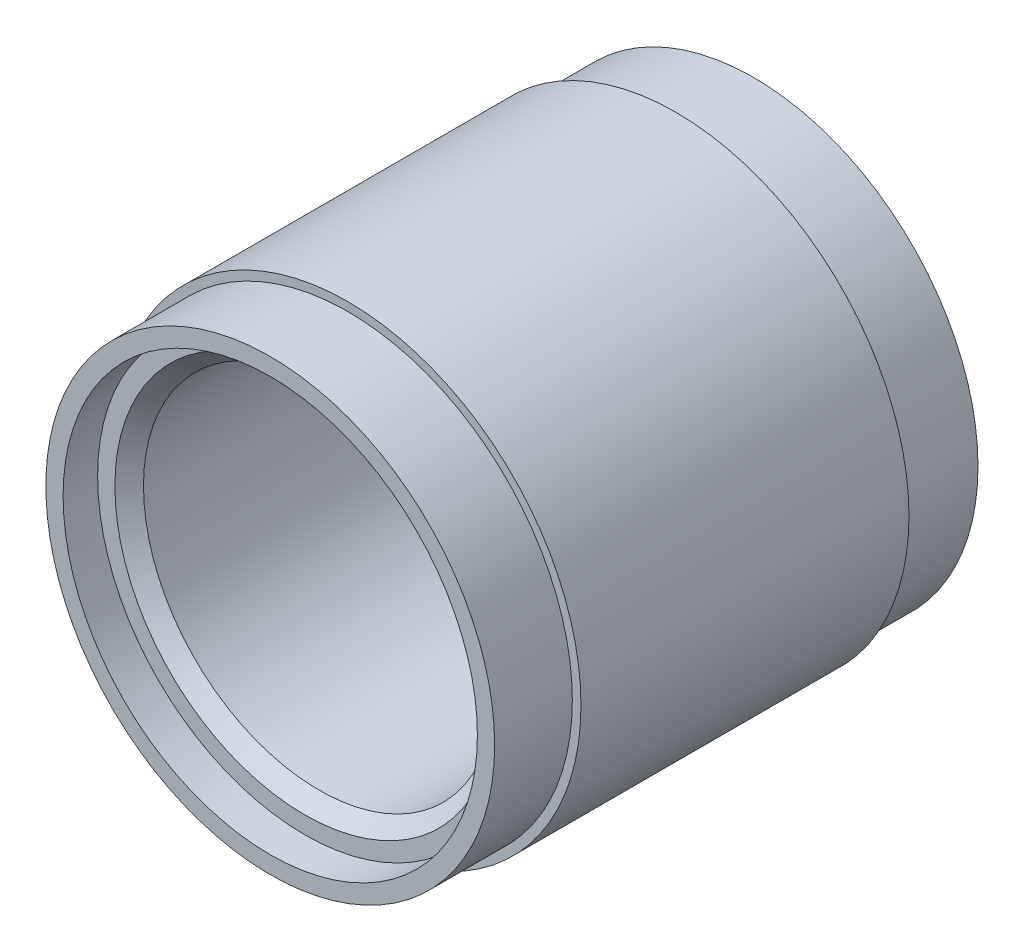
ISO-10303-21;
HEADER;
FILE_DESCRIPTION(('STEP AP214'),'2;1');
FILE_NAME('part.step','',(''),(''),'','','');
FILE_SCHEMA(('AUTOMOTIVE_DESIGN { 1 0 10303 214 1 1 1 1 }'));
ENDSEC;
DATA;
#1=APPLICATION_CONTEXT('core data for automotive mechanical design processes');
#2=APPLICATION_PROTOCOL_DEFINITION('international standard','automotive_design',2000,#1);
#3=PRODUCT_CONTEXT('',#1,'mechanical');
#4=PRODUCT('Part','Part','',(#3));
#5=PRODUCT_RELATED_PRODUCT_CATEGORY('part','',(#4));
#6=PRODUCT_DEFINITION_FORMATION('','',#4);
#7=PRODUCT_DEFINITION_CONTEXT('part definition',#1,'design');
#8=PRODUCT_DEFINITION('design','',#6,#7);
#9=PRODUCT_DEFINITION_SHAPE('','',#8);
#10=(LENGTH_UNIT() NAMED_UNIT(*) SI_UNIT(.MILLI.,.METRE.));
#11=(NAMED_UNIT(*) PLANE_ANGLE_UNIT() SI_UNIT($,.RADIAN.));
#12=(NAMED_UNIT(*) SI_UNIT($,.STERADIAN.) SOLID_ANGLE_UNIT());
#13=UNCERTAINTY_MEASURE_WITH_UNIT(LENGTH_MEASURE(1.E-05),#10,'distance_accuracy_value','');
#14=(GEOMETRIC_REPRESENTATION_CONTEXT(3) GLOBAL_UNCERTAINTY_ASSIGNED_CONTEXT((#13)) GLOBAL_UNIT_ASSIGNED_CONTEXT((#10,
#11,#12)) REPRESENTATION_CONTEXT('',''));
#15=CARTESIAN_POINT('',(0.,0.,0.));
#16=DIRECTION('',(0.,0.,1.));
#17=DIRECTION('',(1.,0.,0.));
#18=AXIS2_PLACEMENT_3D('',#15,#16,#17);
#19=CARTESIAN_POINT('',(0.,0.,4.5));
#20=DIRECTION('',(0.,0.,-1.));
#21=DIRECTION('',(-1.,0.,0.));
#22=AXIS2_PLACEMENT_3D('',#19,#20,#21);
#23=CYLINDRICAL_SURFACE('',#22,13.);
#24=CARTESIAN_POINT('',(0.,0.,4.5));
#25=DIRECTION('',(0.,0.,1.));
#26=DIRECTION('',(1.,0.,0.));
#27=AXIS2_PLACEMENT_3D('',#24,#25,#26);
#28=CIRCLE('',#27,13.);
#29=CARTESIAN_POINT('',(13.,0.,4.5));
#30=VERTEX_POINT('',#29);
#31=EDGE_CURVE('E54',#30,#30,#28,.T.);
#32=ORIENTED_EDGE('',*,*,#31,.F.);
#33=EDGE_LOOP('',(#32));
#34=FACE_BOUND('',#33,.T.);
#35=CARTESIAN_POINT('',(0.,0.,0.));
#36=DIRECTION('',(0.,0.,1.));
#37=DIRECTION('',(1.,0.,0.));
#38=AXIS2_PLACEMENT_3D('',#35,#36,#37);
#39=CIRCLE('',#38,13.);
#40=CARTESIAN_POINT('',(13.,0.,0.));
#41=VERTEX_POINT('',#40);
#42=EDGE_CURVE('E55',#41,#41,#39,.T.);
#43=ORIENTED_EDGE('',*,*,#42,.T.);
#44=EDGE_LOOP('',(#43));
#45=FACE_BOUND('',#44,.T.);
#46=ADVANCED_FACE('F34',(#34,#45),#23,.T.);
#47=CARTESIAN_POINT('',(0.,0.,0.));
#48=DIRECTION('',(0.,0.,1.));
#49=DIRECTION('',(1.,0.,0.));
#50=AXIS2_PLACEMENT_3D('',#47,#48,#49);
#51=PLANE('',#50);
#52=CARTESIAN_POINT('',(0.,0.,0.));
#53=DIRECTION('',(0.,0.,-1.));
#54=DIRECTION('',(-1.,0.,0.));
#55=AXIS2_PLACEMENT_3D('',#52,#53,#54);
#56=CIRCLE('',#55,12.);
#57=CARTESIAN_POINT('',(-12.,0.,0.));
#58=VERTEX_POINT('',#57);
#59=EDGE_CURVE('E64',#58,#58,#56,.T.);
#60=ORIENTED_EDGE('',*,*,#59,.F.);
#61=EDGE_LOOP('',(#60));
#62=FACE_BOUND('',#61,.T.);
#63=ORIENTED_EDGE('',*,*,#42,.F.);
#64=EDGE_LOOP('',(#63));
#65=FACE_BOUND('',#64,.T.);
#66=ADVANCED_FACE('F102',(#62,#65),#51,.F.);
#67=CARTESIAN_POINT('',(0.,0.,4.5));
#68=DIRECTION('',(0.,0.,1.));
#69=DIRECTION('',(1.,0.,0.));
#70=AXIS2_PLACEMENT_3D('',#67,#68,#69);
#71=PLANE('',#70);
#72=CARTESIAN_POINT('',(0.,0.,4.5));
#73=DIRECTION('',(0.,0.,1.));
#74=DIRECTION('',(1.,0.,0.));
#75=AXIS2_PLACEMENT_3D('',#72,#73,#74);
#76=CIRCLE('',#75,13.5);
#77=CARTESIAN_POINT('',(13.5,0.,4.5));
#78=VERTEX_POINT('',#77);
#79=EDGE_CURVE('E58',#78,#78,#76,.T.);
#80=ORIENTED_EDGE('',*,*,#79,.F.);
#81=EDGE_LOOP('',(#80));
#82=FACE_BOUND('',#81,.T.);
#83=ORIENTED_EDGE('',*,*,#31,.T.);
#84=EDGE_LOOP('',(#83));
#85=FACE_BOUND('',#84,.T.);
#86=ADVANCED_FACE('F108',(#82,#85),#71,.F.);
#87=CARTESIAN_POINT('',(0.,0.,14.));
#88=DIRECTION('',(0.,0.,-1.));
#89=DIRECTION('',(-1.,0.,0.));
#90=AXIS2_PLACEMENT_3D('',#87,#88,#89);
#91=CYLINDRICAL_SURFACE('',#90,13.5);
#92=ORIENTED_EDGE('',*,*,#79,.T.);
#93=EDGE_LOOP('',(#92));
#94=FACE_BOUND('',#93,.T.);
#95=CARTESIAN_POINT('',(0.,0.,23.5));
#96=DIRECTION('',(0.,0.,1.));
#97=DIRECTION('',(1.,0.,0.));
#98=AXIS2_PLACEMENT_3D('',#95,#96,#97);
#99=CIRCLE('',#98,13.5);
#100=CARTESIAN_POINT('',(13.5,0.,23.5));
#101=VERTEX_POINT('',#100);
#102=EDGE_CURVE('E73',#101,#101,#99,.T.);
#103=ORIENTED_EDGE('',*,*,#102,.F.);
#104=EDGE_LOOP('',(#103));
#105=FACE_BOUND('',#104,.T.);
#106=ADVANCED_FACE('F169',(#94,#105),#91,.T.);
#107=CARTESIAN_POINT('',(0.,0.,2.));
#108=DIRECTION('',(0.,0.,-1.));
#109=DIRECTION('',(-1.,0.,0.));
#110=AXIS2_PLACEMENT_3D('',#107,#108,#109);
#111=CYLINDRICAL_SURFACE('',#110,12.);
#112=CARTESIAN_POINT('',(0.,0.,2.));
#113=DIRECTION('',(0.,0.,-1.));
#114=DIRECTION('',(-1.,0.,0.));
#115=AXIS2_PLACEMENT_3D('',#112,#113,#114);
#116=CIRCLE('',#115,12.);
#117=CARTESIAN_POINT('',(-12.,0.,2.));
#118=VERTEX_POINT('',#117);
#119=EDGE_CURVE('E63',#118,#118,#116,.T.);
#120=ORIENTED_EDGE('',*,*,#119,.F.);
#121=EDGE_LOOP('',(#120));
#122=FACE_BOUND('',#121,.T.);
#123=ORIENTED_EDGE('',*,*,#59,.T.);
#124=EDGE_LOOP('',(#123));
#125=FACE_BOUND('',#124,.T.);
#126=ADVANCED_FACE('F175',(#122,#125),#111,.F.);
#127=CARTESIAN_POINT('',(0.,0.,2.));
#128=DIRECTION('',(0.,0.,-1.));
#129=DIRECTION('',(-1.,0.,0.));
#130=AXIS2_PLACEMENT_3D('',#127,#128,#129);
#131=PLANE('',#130);
#132=CARTESIAN_POINT('',(0.,0.,2.));
#133=DIRECTION('',(0.,0.,-1.));
#134=DIRECTION('',(-1.,0.,0.));
#135=AXIS2_PLACEMENT_3D('',#132,#133,#134);
#136=CIRCLE('',#135,11.);
#137=CARTESIAN_POINT('',(-11.,0.,2.));
#138=VERTEX_POINT('',#137);
#139=EDGE_CURVE('E10',#138,#138,#136,.F.);
#140=ORIENTED_EDGE('',*,*,#139,.T.);
#141=EDGE_LOOP('',(#140));
#142=FACE_BOUND('',#141,.T.);
#143=ORIENTED_EDGE('',*,*,#119,.T.);
#144=EDGE_LOOP('',(#143));
#145=FACE_BOUND('',#144,.T.);
#146=ADVANCED_FACE('F164',(#142,#145),#131,.T.);
#147=CARTESIAN_POINT('',(0.,0.,23.5));
#148=DIRECTION('',(0.,0.,1.));
#149=DIRECTION('',(-1.,0.,0.));
#150=AXIS2_PLACEMENT_3D('',#147,#148,#149);
#151=CYLINDRICAL_SURFACE('',#150,13.);
#152=CARTESIAN_POINT('',(0.,0.,23.5));
#153=DIRECTION('',(0.,0.,1.));
#154=DIRECTION('',(1.,0.,0.));
#155=AXIS2_PLACEMENT_3D('',#152,#153,#154);
#156=CIRCLE('',#155,13.);
#157=CARTESIAN_POINT('',(13.,0.,23.5));
#158=VERTEX_POINT('',#157);
#159=EDGE_CURVE('E67',#158,#158,#156,.T.);
#160=ORIENTED_EDGE('',*,*,#159,.T.);
#161=EDGE_LOOP('',(#160));
#162=FACE_BOUND('',#161,.T.);
#163=CARTESIAN_POINT('',(0.,0.,28.));
#164=DIRECTION('',(0.,0.,1.));
#165=DIRECTION('',(1.,0.,0.));
#166=AXIS2_PLACEMENT_3D('',#163,#164,#165);
#167=CIRCLE('',#166,13.);
#168=CARTESIAN_POINT('',(13.,0.,28.));
#169=VERTEX_POINT('',#168);
#170=EDGE_CURVE('E70',#169,#169,#167,.T.);
#171=ORIENTED_EDGE('',*,*,#170,.F.);
#172=EDGE_LOOP('',(#171));
#173=FACE_BOUND('',#172,.T.);
#174=ADVANCED_FACE('F156',(#162,#173),#151,.T.);
#175=CARTESIAN_POINT('',(0.,0.,28.));
#176=DIRECTION('',(0.,0.,-1.));
#177=DIRECTION('',(1.,0.,0.));
#178=AXIS2_PLACEMENT_3D('',#175,#176,#177);
#179=PLANE('',#178);
#180=CARTESIAN_POINT('',(0.,0.,28.));
#181=DIRECTION('',(0.,0.,-1.));
#182=DIRECTION('',(-1.,0.,0.));
#183=AXIS2_PLACEMENT_3D('',#180,#181,#182);
#184=CIRCLE('',#183,12.);
#185=CARTESIAN_POINT('',(-12.,0.,28.));
#186=VERTEX_POINT('',#185);
#187=EDGE_CURVE('E79',#186,#186,#184,.T.);
#188=ORIENTED_EDGE('',*,*,#187,.T.);
#189=EDGE_LOOP('',(#188));
#190=FACE_BOUND('',#189,.T.);
#191=ORIENTED_EDGE('',*,*,#170,.T.);
#192=EDGE_LOOP('',(#191));
#193=FACE_BOUND('',#192,.T.);
#194=ADVANCED_FACE('F148',(#190,#193),#179,.F.);
#195=CARTESIAN_POINT('',(0.,0.,23.5));
#196=DIRECTION('',(0.,0.,-1.));
#197=DIRECTION('',(1.,0.,0.));
#198=AXIS2_PLACEMENT_3D('',#195,#196,#197);
#199=PLANE('',#198);
#200=ORIENTED_EDGE('',*,*,#102,.T.);
#201=EDGE_LOOP('',(#200));
#202=FACE_BOUND('',#201,.T.);
#203=ORIENTED_EDGE('',*,*,#159,.F.);
#204=EDGE_LOOP('',(#203));
#205=FACE_BOUND('',#204,.T.);
#206=ADVANCED_FACE('F99',(#202,#205),#199,.F.);
#207=CARTESIAN_POINT('',(0.,0.,26.));
#208=DIRECTION('',(0.,0.,1.));
#209=DIRECTION('',(-1.,0.,0.));
#210=AXIS2_PLACEMENT_3D('',#207,#208,#209);
#211=CYLINDRICAL_SURFACE('',#210,12.);
#212=CARTESIAN_POINT('',(0.,0.,26.));
#213=DIRECTION('',(0.,0.,-1.));
#214=DIRECTION('',(-1.,0.,0.));
#215=AXIS2_PLACEMENT_3D('',#212,#213,#214);
#216=CIRCLE('',#215,12.);
#217=CARTESIAN_POINT('',(-12.,0.,26.));
#218=VERTEX_POINT('',#217);
#219=EDGE_CURVE('E78',#218,#218,#216,.T.);
#220=ORIENTED_EDGE('',*,*,#219,.T.);
#221=EDGE_LOOP('',(#220));
#222=FACE_BOUND('',#221,.T.);
#223=ORIENTED_EDGE('',*,*,#187,.F.);
#224=EDGE_LOOP('',(#223));
#225=FACE_BOUND('',#224,.T.);
#226=ADVANCED_FACE('F85',(#222,#225),#211,.F.);
#227=CARTESIAN_POINT('',(0.,0.,26.));
#228=DIRECTION('',(0.,0.,1.));
#229=DIRECTION('',(-1.,0.,0.));
#230=AXIS2_PLACEMENT_3D('',#227,#228,#229);
#231=PLANE('',#230);
#232=CARTESIAN_POINT('',(0.,0.,26.));
#233=DIRECTION('',(0.,0.,1.));
#234=DIRECTION('',(1.,0.,0.));
#235=AXIS2_PLACEMENT_3D('',#232,#233,#234);
#236=CIRCLE('',#235,11.);
#237=CARTESIAN_POINT('',(11.,0.,26.));
#238=VERTEX_POINT('',#237);
#239=EDGE_CURVE('E41',#238,#238,#236,.F.);
#240=ORIENTED_EDGE('',*,*,#239,.T.);
#241=EDGE_LOOP('',(#240));
#242=FACE_BOUND('',#241,.T.);
#243=ORIENTED_EDGE('',*,*,#219,.F.);
#244=EDGE_LOOP('',(#243));
#245=FACE_BOUND('',#244,.T.);
#246=ADVANCED_FACE('F88',(#242,#245),#231,.T.);
#247=CARTESIAN_POINT('',(0.,0.,28.));
#248=DIRECTION('',(0.,0.,-1.));
#249=DIRECTION('',(-1.,0.,0.));
#250=AXIS2_PLACEMENT_3D('',#247,#248,#249);
#251=CYLINDRICAL_SURFACE('',#250,10.172);
#252=CARTESIAN_POINT('',(0.,0.,25.172));
#253=DIRECTION('',(0.,0.,1.));
#254=DIRECTION('',(1.,0.,0.));
#255=AXIS2_PLACEMENT_3D('',#252,#253,#254);
#256=CIRCLE('',#255,10.172);
#257=CARTESIAN_POINT('',(10.172,0.,25.172));
#258=VERTEX_POINT('',#257);
#259=EDGE_CURVE('E45',#258,#258,#256,.T.);
#260=ORIENTED_EDGE('',*,*,#259,.T.);
#261=EDGE_LOOP('',(#260));
#262=FACE_BOUND('',#261,.T.);
#263=CARTESIAN_POINT('',(0.,0.,2.82799999999999));
#264=DIRECTION('',(0.,0.,-1.));
#265=DIRECTION('',(-1.,0.,0.));
#266=AXIS2_PLACEMENT_3D('',#263,#264,#265);
#267=CIRCLE('',#266,10.172);
#268=CARTESIAN_POINT('',(-10.172,0.,2.82799999999999));
#269=VERTEX_POINT('',#268);
#270=EDGE_CURVE('E49',#269,#269,#267,.T.);
#271=ORIENTED_EDGE('',*,*,#270,.T.);
#272=EDGE_LOOP('',(#271));
#273=FACE_BOUND('',#272,.T.);
#274=ADVANCED_FACE('F90',(#262,#273),#251,.F.);
#275=CARTESIAN_POINT('',(0.,0.,25.172));
#276=DIRECTION('',(0.,0.,1.));
#277=DIRECTION('',(1.,0.,0.));
#278=AXIS2_PLACEMENT_3D('',#275,#276,#277);
#279=CONICAL_SURFACE('',#278,10.172,0.785398163397446);
#280=ORIENTED_EDGE('',*,*,#239,.F.);
#281=EDGE_LOOP('',(#280));
#282=FACE_BOUND('',#281,.T.);
#283=ORIENTED_EDGE('',*,*,#259,.F.);
#284=EDGE_LOOP('',(#283));
#285=FACE_BOUND('',#284,.T.);
#286=ADVANCED_FACE('F96',(#282,#285),#279,.F.);
#287=CARTESIAN_POINT('',(0.,0.,2.82799999999999));
#288=DIRECTION('',(0.,0.,-1.));
#289=DIRECTION('',(-1.,0.,0.));
#290=AXIS2_PLACEMENT_3D('',#287,#288,#289);
#291=CONICAL_SURFACE('',#290,10.172,0.785398163397448);
#292=ORIENTED_EDGE('',*,*,#139,.F.);
#293=EDGE_LOOP('',(#292));
#294=FACE_BOUND('',#293,.T.);
#295=ORIENTED_EDGE('',*,*,#270,.F.);
#296=EDGE_LOOP('',(#295));
#297=FACE_BOUND('',#296,.T.);
#298=ADVANCED_FACE('F36',(#294,#297),#291,.F.);
#299=CLOSED_SHELL('',(#46,#66,#86,#106,#126,#146,#174,#194,#206,#226,#246,#274,#286,#298));
#300=MANIFOLD_SOLID_BREP('B2',#299);
#301=ADVANCED_BREP_SHAPE_REPRESENTATION('',(#18,#300),#14);
#302=SHAPE_DEFINITION_REPRESENTATION(#9,#301);
ENDSEC;
END-ISO-10303-21;
